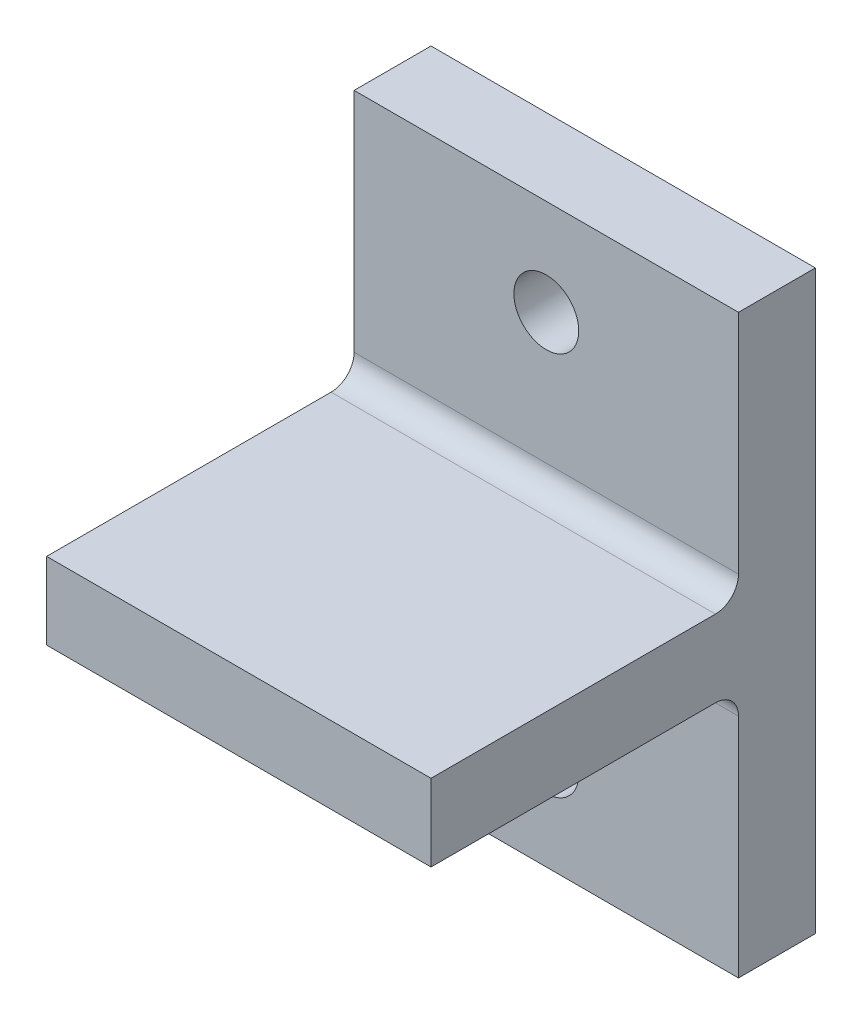
ISO-10303-21;
HEADER;
FILE_DESCRIPTION(('STEP AP214'),'2;1');
FILE_NAME('part.step','',(''),(''),'','','');
FILE_SCHEMA(('AUTOMOTIVE_DESIGN { 1 0 10303 214 1 1 1 1 }'));
ENDSEC;
DATA;
#1=APPLICATION_CONTEXT('core data for automotive mechanical design processes');
#2=APPLICATION_PROTOCOL_DEFINITION('international standard','automotive_design',2000,#1);
#3=PRODUCT_CONTEXT('',#1,'mechanical');
#4=PRODUCT('Part','Part','',(#3));
#5=PRODUCT_RELATED_PRODUCT_CATEGORY('part','',(#4));
#6=PRODUCT_DEFINITION_FORMATION('','',#4);
#7=PRODUCT_DEFINITION_CONTEXT('part definition',#1,'design');
#8=PRODUCT_DEFINITION('design','',#6,#7);
#9=PRODUCT_DEFINITION_SHAPE('','',#8);
#10=(LENGTH_UNIT() NAMED_UNIT(*) SI_UNIT(.MILLI.,.METRE.));
#11=(NAMED_UNIT(*) PLANE_ANGLE_UNIT() SI_UNIT($,.RADIAN.));
#12=(NAMED_UNIT(*) SI_UNIT($,.STERADIAN.) SOLID_ANGLE_UNIT());
#13=UNCERTAINTY_MEASURE_WITH_UNIT(LENGTH_MEASURE(1.E-05),#10,'distance_accuracy_value','');
#14=(GEOMETRIC_REPRESENTATION_CONTEXT(3) GLOBAL_UNCERTAINTY_ASSIGNED_CONTEXT((#13)) GLOBAL_UNIT_ASSIGNED_CONTEXT((#10,
#11,#12)) REPRESENTATION_CONTEXT('',''));
#15=CARTESIAN_POINT('',(0.,0.,0.));
#16=DIRECTION('',(0.,0.,1.));
#17=DIRECTION('',(1.,0.,0.));
#18=AXIS2_PLACEMENT_3D('',#15,#16,#17);
#19=CARTESIAN_POINT('',(0.,0.,10.));
#20=DIRECTION('',(0.,0.,-1.));
#21=DIRECTION('',(-1.,0.,0.));
#22=AXIS2_PLACEMENT_3D('',#19,#20,#21);
#23=PLANE('',#22);
#24=CARTESIAN_POINT('',(0.,-25.,10.));
#25=DIRECTION('',(0.,0.,-1.));
#26=DIRECTION('',(-1.,0.,0.));
#27=AXIS2_PLACEMENT_3D('',#24,#25,#26);
#28=CIRCLE('',#27,4.21639999999999);
#29=CARTESIAN_POINT('',(-4.21639999999999,-25.,10.));
#30=VERTEX_POINT('',#29);
#31=EDGE_CURVE('E128',#30,#30,#28,.T.);
#32=ORIENTED_EDGE('',*,*,#31,.T.);
#33=EDGE_LOOP('',(#32));
#34=FACE_BOUND('',#33,.T.);
#35=DIRECTION('',(0.,1.,0.));
#36=VECTOR('',#35,1.);
#37=CARTESIAN_POINT('',(25.,-37.5,10.));
#38=LINE('',#37,#36);
#39=CARTESIAN_POINT('',(25.,-37.5,10.));
#40=VERTEX_POINT('',#39);
#41=CARTESIAN_POINT('',(25.,-8.,10.));
#42=VERTEX_POINT('',#41);
#43=EDGE_CURVE('E171',#40,#42,#38,.T.);
#44=ORIENTED_EDGE('',*,*,#43,.T.);
#45=DIRECTION('',(1.,0.,0.));
#46=VECTOR('',#45,1.);
#47=CARTESIAN_POINT('',(-25.,-8.,10.));
#48=LINE('',#47,#46);
#49=CARTESIAN_POINT('',(-25.,-8.,10.));
#50=VERTEX_POINT('',#49);
#51=EDGE_CURVE('E155',#42,#50,#48,.F.);
#52=ORIENTED_EDGE('',*,*,#51,.T.);
#53=DIRECTION('',(0.,-1.,0.));
#54=VECTOR('',#53,1.);
#55=CARTESIAN_POINT('',(-25.,-37.5,10.));
#56=LINE('',#55,#54);
#57=CARTESIAN_POINT('',(-25.,-37.5,10.));
#58=VERTEX_POINT('',#57);
#59=EDGE_CURVE('E157',#50,#58,#56,.T.);
#60=ORIENTED_EDGE('',*,*,#59,.T.);
#61=DIRECTION('',(1.,0.,0.));
#62=VECTOR('',#61,1.);
#63=CARTESIAN_POINT('',(-25.,-37.5,10.));
#64=LINE('',#63,#62);
#65=EDGE_CURVE('E167',#58,#40,#64,.T.);
#66=ORIENTED_EDGE('',*,*,#65,.T.);
#67=EDGE_LOOP('',(#44,#52,#60,#66));
#68=FACE_BOUND('',#67,.T.);
#69=ADVANCED_FACE('F32',(#34,#68),#23,.F.);
#70=CARTESIAN_POINT('',(0.,25.,10.));
#71=DIRECTION('',(0.,0.,-1.));
#72=DIRECTION('',(-1.,0.,0.));
#73=AXIS2_PLACEMENT_3D('',#70,#71,#72);
#74=CIRCLE('',#73,4.21639999999999);
#75=CARTESIAN_POINT('',(-4.21639999999999,25.,10.));
#76=VERTEX_POINT('',#75);
#77=EDGE_CURVE('E267',#76,#76,#74,.T.);
#78=ORIENTED_EDGE('',*,*,#77,.T.);
#79=EDGE_LOOP('',(#78));
#80=FACE_BOUND('',#79,.T.);
#81=CARTESIAN_POINT('',(-25.,37.5,10.));
#82=VERTEX_POINT('',#81);
#83=CARTESIAN_POINT('',(-25.,8.,10.));
#84=VERTEX_POINT('',#83);
#85=EDGE_CURVE('E160',#82,#84,#56,.T.);
#86=ORIENTED_EDGE('',*,*,#85,.T.);
#87=DIRECTION('',(-1.,0.,0.));
#88=VECTOR('',#87,1.);
#89=CARTESIAN_POINT('',(25.,8.,10.));
#90=LINE('',#89,#88);
#91=CARTESIAN_POINT('',(25.,8.,10.));
#92=VERTEX_POINT('',#91);
#93=EDGE_CURVE('E53',#84,#92,#90,.F.);
#94=ORIENTED_EDGE('',*,*,#93,.T.);
#95=CARTESIAN_POINT('',(25.,37.5,10.));
#96=VERTEX_POINT('',#95);
#97=EDGE_CURVE('E174',#92,#96,#38,.T.);
#98=ORIENTED_EDGE('',*,*,#97,.T.);
#99=DIRECTION('',(-1.,0.,0.));
#100=VECTOR('',#99,1.);
#101=CARTESIAN_POINT('',(-25.,37.5,10.));
#102=LINE('',#101,#100);
#103=EDGE_CURVE('E161',#96,#82,#102,.T.);
#104=ORIENTED_EDGE('',*,*,#103,.T.);
#105=EDGE_LOOP('',(#86,#94,#98,#104));
#106=FACE_BOUND('',#105,.T.);
#107=ADVANCED_FACE('F241',(#80,#106),#23,.F.);
#108=CARTESIAN_POINT('',(25.,-37.5,10.));
#109=DIRECTION('',(-1.,0.,0.));
#110=DIRECTION('',(0.,0.,1.));
#111=AXIS2_PLACEMENT_3D('',#108,#109,#110);
#112=PLANE('',#111);
#113=DIRECTION('',(0.,1.,0.));
#114=VECTOR('',#113,1.);
#115=CARTESIAN_POINT('',(25.,-37.5,0.));
#116=LINE('',#115,#114);
#117=CARTESIAN_POINT('',(25.,-37.5,0.));
#118=VERTEX_POINT('',#117);
#119=CARTESIAN_POINT('',(25.,37.5,0.));
#120=VERTEX_POINT('',#119);
#121=EDGE_CURVE('E133',#118,#120,#116,.T.);
#122=ORIENTED_EDGE('',*,*,#121,.T.);
#123=DIRECTION('',(0.,0.,-1.));
#124=VECTOR('',#123,1.);
#125=CARTESIAN_POINT('',(25.,37.5,10.));
#126=LINE('',#125,#124);
#127=EDGE_CURVE('E156',#96,#120,#126,.T.);
#128=ORIENTED_EDGE('',*,*,#127,.F.);
#129=ORIENTED_EDGE('',*,*,#97,.F.);
#130=CARTESIAN_POINT('',(25.,8.,13.));
#131=DIRECTION('',(-1.,0.,0.));
#132=DIRECTION('',(0.,0.,1.));
#133=AXIS2_PLACEMENT_3D('',#130,#131,#132);
#134=CIRCLE('',#133,3.);
#135=CARTESIAN_POINT('',(25.,5.,13.));
#136=VERTEX_POINT('',#135);
#137=EDGE_CURVE('E11',#92,#136,#134,.T.);
#138=ORIENTED_EDGE('',*,*,#137,.T.);
#139=DIRECTION('',(0.,0.,-1.));
#140=VECTOR('',#139,1.);
#141=CARTESIAN_POINT('',(25.,5.,50.));
#142=LINE('',#141,#140);
#143=CARTESIAN_POINT('',(25.,5.,50.));
#144=VERTEX_POINT('',#143);
#145=EDGE_CURVE('E113',#144,#136,#142,.T.);
#146=ORIENTED_EDGE('',*,*,#145,.F.);
#147=DIRECTION('',(0.,1.,0.));
#148=VECTOR('',#147,1.);
#149=CARTESIAN_POINT('',(25.,-5.,50.));
#150=LINE('',#149,#148);
#151=CARTESIAN_POINT('',(25.,-5.,50.));
#152=VERTEX_POINT('',#151);
#153=EDGE_CURVE('E119',#152,#144,#150,.T.);
#154=ORIENTED_EDGE('',*,*,#153,.F.);
#155=DIRECTION('',(0.,0.,-1.));
#156=VECTOR('',#155,1.);
#157=CARTESIAN_POINT('',(25.,-5.,50.));
#158=LINE('',#157,#156);
#159=CARTESIAN_POINT('',(25.,-5.,13.));
#160=VERTEX_POINT('',#159);
#161=EDGE_CURVE('E144',#152,#160,#158,.T.);
#162=ORIENTED_EDGE('',*,*,#161,.T.);
#163=CARTESIAN_POINT('',(25.,-8.,13.));
#164=DIRECTION('',(-1.,0.,0.));
#165=DIRECTION('',(0.,0.,1.));
#166=AXIS2_PLACEMENT_3D('',#163,#164,#165);
#167=CIRCLE('',#166,3.);
#168=EDGE_CURVE('E185',#160,#42,#167,.T.);
#169=ORIENTED_EDGE('',*,*,#168,.T.);
#170=ORIENTED_EDGE('',*,*,#43,.F.);
#171=DIRECTION('',(0.,0.,-1.));
#172=VECTOR('',#171,1.);
#173=CARTESIAN_POINT('',(25.,-37.5,10.));
#174=LINE('',#173,#172);
#175=EDGE_CURVE('E206',#40,#118,#174,.T.);
#176=ORIENTED_EDGE('',*,*,#175,.T.);
#177=EDGE_LOOP('',(#122,#128,#129,#138,#146,#154,#162,#169,#170,#176));
#178=FACE_BOUND('',#177,.T.);
#179=ADVANCED_FACE('F131',(#178),#112,.F.);
#180=CARTESIAN_POINT('',(-25.,37.5,10.));
#181=DIRECTION('',(0.,-1.,0.));
#182=DIRECTION('',(0.,0.,-1.));
#183=AXIS2_PLACEMENT_3D('',#180,#181,#182);
#184=PLANE('',#183);
#185=DIRECTION('',(-1.,0.,0.));
#186=VECTOR('',#185,1.);
#187=CARTESIAN_POINT('',(-25.,37.5,0.));
#188=LINE('',#187,#186);
#189=CARTESIAN_POINT('',(-25.,37.5,0.));
#190=VERTEX_POINT('',#189);
#191=EDGE_CURVE('E135',#120,#190,#188,.T.);
#192=ORIENTED_EDGE('',*,*,#191,.T.);
#193=DIRECTION('',(0.,0.,-1.));
#194=VECTOR('',#193,1.);
#195=CARTESIAN_POINT('',(-25.,37.5,10.));
#196=LINE('',#195,#194);
#197=EDGE_CURVE('E212',#82,#190,#196,.T.);
#198=ORIENTED_EDGE('',*,*,#197,.F.);
#199=ORIENTED_EDGE('',*,*,#103,.F.);
#200=ORIENTED_EDGE('',*,*,#127,.T.);
#201=EDGE_LOOP('',(#192,#198,#199,#200));
#202=FACE_BOUND('',#201,.T.);
#203=ADVANCED_FACE('F223',(#202),#184,.F.);
#204=CARTESIAN_POINT('',(-25.,-37.5,10.));
#205=DIRECTION('',(1.,0.,0.));
#206=DIRECTION('',(0.,0.,-1.));
#207=AXIS2_PLACEMENT_3D('',#204,#205,#206);
#208=PLANE('',#207);
#209=DIRECTION('',(0.,-1.,0.));
#210=VECTOR('',#209,1.);
#211=CARTESIAN_POINT('',(-25.,-37.5,0.));
#212=LINE('',#211,#210);
#213=CARTESIAN_POINT('',(-25.,-37.5,0.));
#214=VERTEX_POINT('',#213);
#215=EDGE_CURVE('E226',#190,#214,#212,.T.);
#216=ORIENTED_EDGE('',*,*,#215,.T.);
#217=DIRECTION('',(0.,0.,-1.));
#218=VECTOR('',#217,1.);
#219=CARTESIAN_POINT('',(-25.,-37.5,10.));
#220=LINE('',#219,#218);
#221=EDGE_CURVE('E210',#58,#214,#220,.T.);
#222=ORIENTED_EDGE('',*,*,#221,.F.);
#223=ORIENTED_EDGE('',*,*,#59,.F.);
#224=CARTESIAN_POINT('',(-25.,-8.,13.));
#225=DIRECTION('',(1.,0.,0.));
#226=DIRECTION('',(0.,0.,-1.));
#227=AXIS2_PLACEMENT_3D('',#224,#225,#226);
#228=CIRCLE('',#227,3.);
#229=CARTESIAN_POINT('',(-25.,-5.,13.));
#230=VERTEX_POINT('',#229);
#231=EDGE_CURVE('E187',#50,#230,#228,.T.);
#232=ORIENTED_EDGE('',*,*,#231,.T.);
#233=DIRECTION('',(0.,0.,-1.));
#234=VECTOR('',#233,1.);
#235=CARTESIAN_POINT('',(-25.,-5.,50.));
#236=LINE('',#235,#234);
#237=CARTESIAN_POINT('',(-25.,-5.,50.));
#238=VERTEX_POINT('',#237);
#239=EDGE_CURVE('E137',#238,#230,#236,.T.);
#240=ORIENTED_EDGE('',*,*,#239,.F.);
#241=DIRECTION('',(0.,-1.,0.));
#242=VECTOR('',#241,1.);
#243=CARTESIAN_POINT('',(-25.,-5.,50.));
#244=LINE('',#243,#242);
#245=CARTESIAN_POINT('',(-25.,5.,50.));
#246=VERTEX_POINT('',#245);
#247=EDGE_CURVE('E118',#246,#238,#244,.T.);
#248=ORIENTED_EDGE('',*,*,#247,.F.);
#249=DIRECTION('',(0.,0.,-1.));
#250=VECTOR('',#249,1.);
#251=CARTESIAN_POINT('',(-25.,5.,50.));
#252=LINE('',#251,#250);
#253=CARTESIAN_POINT('',(-25.,5.,13.));
#254=VERTEX_POINT('',#253);
#255=EDGE_CURVE('E115',#246,#254,#252,.T.);
#256=ORIENTED_EDGE('',*,*,#255,.T.);
#257=CARTESIAN_POINT('',(-25.,8.,13.));
#258=DIRECTION('',(1.,0.,0.));
#259=DIRECTION('',(0.,0.,-1.));
#260=AXIS2_PLACEMENT_3D('',#257,#258,#259);
#261=CIRCLE('',#260,3.);
#262=EDGE_CURVE('E40',#254,#84,#261,.T.);
#263=ORIENTED_EDGE('',*,*,#262,.T.);
#264=ORIENTED_EDGE('',*,*,#85,.F.);
#265=ORIENTED_EDGE('',*,*,#197,.T.);
#266=EDGE_LOOP('',(#216,#222,#223,#232,#240,#248,#256,#263,#264,#265));
#267=FACE_BOUND('',#266,.T.);
#268=ADVANCED_FACE('F191',(#267),#208,.F.);
#269=CARTESIAN_POINT('',(-25.,-37.5,10.));
#270=DIRECTION('',(0.,1.,0.));
#271=DIRECTION('',(0.,0.,1.));
#272=AXIS2_PLACEMENT_3D('',#269,#270,#271);
#273=PLANE('',#272);
#274=DIRECTION('',(1.,0.,0.));
#275=VECTOR('',#274,1.);
#276=CARTESIAN_POINT('',(-25.,-37.5,0.));
#277=LINE('',#276,#275);
#278=EDGE_CURVE('E182',#214,#118,#277,.T.);
#279=ORIENTED_EDGE('',*,*,#278,.T.);
#280=ORIENTED_EDGE('',*,*,#175,.F.);
#281=ORIENTED_EDGE('',*,*,#65,.F.);
#282=ORIENTED_EDGE('',*,*,#221,.T.);
#283=EDGE_LOOP('',(#279,#280,#281,#282));
#284=FACE_BOUND('',#283,.T.);
#285=ADVANCED_FACE('F207',(#284),#273,.F.);
#286=CARTESIAN_POINT('',(0.,0.,0.));
#287=DIRECTION('',(0.,0.,-1.));
#288=DIRECTION('',(-1.,0.,0.));
#289=AXIS2_PLACEMENT_3D('',#286,#287,#288);
#290=PLANE('',#289);
#291=CARTESIAN_POINT('',(0.,25.,0.));
#292=DIRECTION('',(0.,0.,-1.));
#293=DIRECTION('',(-1.,0.,0.));
#294=AXIS2_PLACEMENT_3D('',#291,#292,#293);
#295=CIRCLE('',#294,4.21639999999999);
#296=CARTESIAN_POINT('',(-4.21639999999999,25.,0.));
#297=VERTEX_POINT('',#296);
#298=EDGE_CURVE('E264',#297,#297,#295,.T.);
#299=ORIENTED_EDGE('',*,*,#298,.F.);
#300=EDGE_LOOP('',(#299));
#301=FACE_BOUND('',#300,.T.);
#302=CARTESIAN_POINT('',(0.,-25.,0.));
#303=DIRECTION('',(0.,0.,-1.));
#304=DIRECTION('',(-1.,0.,0.));
#305=AXIS2_PLACEMENT_3D('',#302,#303,#304);
#306=CIRCLE('',#305,4.21639999999999);
#307=CARTESIAN_POINT('',(-4.21639999999999,-25.,0.));
#308=VERTEX_POINT('',#307);
#309=EDGE_CURVE('E268',#308,#308,#306,.T.);
#310=ORIENTED_EDGE('',*,*,#309,.F.);
#311=EDGE_LOOP('',(#310));
#312=FACE_BOUND('',#311,.T.);
#313=ORIENTED_EDGE('',*,*,#121,.F.);
#314=ORIENTED_EDGE('',*,*,#278,.F.);
#315=ORIENTED_EDGE('',*,*,#215,.F.);
#316=ORIENTED_EDGE('',*,*,#191,.F.);
#317=EDGE_LOOP('',(#313,#314,#315,#316));
#318=FACE_BOUND('',#317,.T.);
#319=ADVANCED_FACE('F225',(#301,#312,#318),#290,.T.);
#320=CARTESIAN_POINT('',(-25.,5.,50.));
#321=DIRECTION('',(0.,-1.,0.));
#322=DIRECTION('',(0.,0.,-1.));
#323=AXIS2_PLACEMENT_3D('',#320,#321,#322);
#324=PLANE('',#323);
#325=ORIENTED_EDGE('',*,*,#145,.T.);
#326=DIRECTION('',(-1.,0.,0.));
#327=VECTOR('',#326,1.);
#328=CARTESIAN_POINT('',(-25.,5.,13.));
#329=LINE('',#328,#327);
#330=EDGE_CURVE('E183',#136,#254,#329,.T.);
#331=ORIENTED_EDGE('',*,*,#330,.T.);
#332=ORIENTED_EDGE('',*,*,#255,.F.);
#333=DIRECTION('',(-1.,0.,0.));
#334=VECTOR('',#333,1.);
#335=CARTESIAN_POINT('',(-25.,5.,50.));
#336=LINE('',#335,#334);
#337=EDGE_CURVE('E108',#144,#246,#336,.T.);
#338=ORIENTED_EDGE('',*,*,#337,.F.);
#339=EDGE_LOOP('',(#325,#331,#332,#338));
#340=FACE_BOUND('',#339,.T.);
#341=ADVANCED_FACE('F110',(#340),#324,.F.);
#342=CARTESIAN_POINT('',(-25.,-5.,50.));
#343=DIRECTION('',(0.,1.,0.));
#344=DIRECTION('',(0.,0.,1.));
#345=AXIS2_PLACEMENT_3D('',#342,#343,#344);
#346=PLANE('',#345);
#347=ORIENTED_EDGE('',*,*,#239,.T.);
#348=DIRECTION('',(1.,0.,0.));
#349=VECTOR('',#348,1.);
#350=CARTESIAN_POINT('',(25.,-5.,13.));
#351=LINE('',#350,#349);
#352=EDGE_CURVE('E152',#230,#160,#351,.T.);
#353=ORIENTED_EDGE('',*,*,#352,.T.);
#354=ORIENTED_EDGE('',*,*,#161,.F.);
#355=DIRECTION('',(1.,0.,0.));
#356=VECTOR('',#355,1.);
#357=CARTESIAN_POINT('',(-25.,-5.,50.));
#358=LINE('',#357,#356);
#359=EDGE_CURVE('E124',#238,#152,#358,.T.);
#360=ORIENTED_EDGE('',*,*,#359,.F.);
#361=EDGE_LOOP('',(#347,#353,#354,#360));
#362=FACE_BOUND('',#361,.T.);
#363=ADVANCED_FACE('F197',(#362),#346,.F.);
#364=CARTESIAN_POINT('',(0.,0.,50.));
#365=DIRECTION('',(0.,0.,-1.));
#366=DIRECTION('',(-1.,0.,0.));
#367=AXIS2_PLACEMENT_3D('',#364,#365,#366);
#368=PLANE('',#367);
#369=ORIENTED_EDGE('',*,*,#153,.T.);
#370=ORIENTED_EDGE('',*,*,#337,.T.);
#371=ORIENTED_EDGE('',*,*,#247,.T.);
#372=ORIENTED_EDGE('',*,*,#359,.T.);
#373=EDGE_LOOP('',(#369,#370,#371,#372));
#374=FACE_BOUND('',#373,.T.);
#375=ADVANCED_FACE('F122',(#374),#368,.F.);
#376=CARTESIAN_POINT('',(-25.,-8.,13.));
#377=DIRECTION('',(-1.,0.,0.));
#378=DIRECTION('',(0.,0.,1.));
#379=AXIS2_PLACEMENT_3D('',#376,#377,#378);
#380=CYLINDRICAL_SURFACE('',#379,3.);
#381=ORIENTED_EDGE('',*,*,#231,.F.);
#382=ORIENTED_EDGE('',*,*,#51,.F.);
#383=ORIENTED_EDGE('',*,*,#168,.F.);
#384=ORIENTED_EDGE('',*,*,#352,.F.);
#385=EDGE_LOOP('',(#381,#382,#383,#384));
#386=FACE_BOUND('',#385,.T.);
#387=ADVANCED_FACE('F198',(#386),#380,.F.);
#388=CARTESIAN_POINT('',(-25.,8.,13.));
#389=DIRECTION('',(1.,0.,0.));
#390=DIRECTION('',(0.,0.,-1.));
#391=AXIS2_PLACEMENT_3D('',#388,#389,#390);
#392=CYLINDRICAL_SURFACE('',#391,3.);
#393=ORIENTED_EDGE('',*,*,#137,.F.);
#394=ORIENTED_EDGE('',*,*,#93,.F.);
#395=ORIENTED_EDGE('',*,*,#262,.F.);
#396=ORIENTED_EDGE('',*,*,#330,.F.);
#397=EDGE_LOOP('',(#393,#394,#395,#396));
#398=FACE_BOUND('',#397,.T.);
#399=ADVANCED_FACE('F34',(#398),#392,.F.);
#400=CARTESIAN_POINT('',(0.,-25.,0.));
#401=DIRECTION('',(0.,0.,-1.));
#402=DIRECTION('',(-1.,0.,0.));
#403=AXIS2_PLACEMENT_3D('',#400,#401,#402);
#404=CYLINDRICAL_SURFACE('',#403,4.21639999999999);
#405=ORIENTED_EDGE('',*,*,#309,.T.);
#406=EDGE_LOOP('',(#405));
#407=FACE_BOUND('',#406,.T.);
#408=ORIENTED_EDGE('',*,*,#31,.F.);
#409=EDGE_LOOP('',(#408));
#410=FACE_BOUND('',#409,.T.);
#411=ADVANCED_FACE('F253',(#407,#410),#404,.F.);
#412=CARTESIAN_POINT('',(0.,25.,0.));
#413=DIRECTION('',(0.,0.,-1.));
#414=DIRECTION('',(-1.,0.,0.));
#415=AXIS2_PLACEMENT_3D('',#412,#413,#414);
#416=CYLINDRICAL_SURFACE('',#415,4.21639999999999);
#417=ORIENTED_EDGE('',*,*,#298,.T.);
#418=EDGE_LOOP('',(#417));
#419=FACE_BOUND('',#418,.T.);
#420=ORIENTED_EDGE('',*,*,#77,.F.);
#421=EDGE_LOOP('',(#420));
#422=FACE_BOUND('',#421,.T.);
#423=ADVANCED_FACE('F256',(#419,#422),#416,.F.);
#424=CLOSED_SHELL('',(#69,#107,#179,#203,#268,#285,#319,#341,#363,#375,#387,#399,#411,#423));
#425=MANIFOLD_SOLID_BREP('B2',#424);
#426=ADVANCED_BREP_SHAPE_REPRESENTATION('',(#18,#425),#14);
#427=SHAPE_DEFINITION_REPRESENTATION(#9,#426);
ENDSEC;
END-ISO-10303-21;
